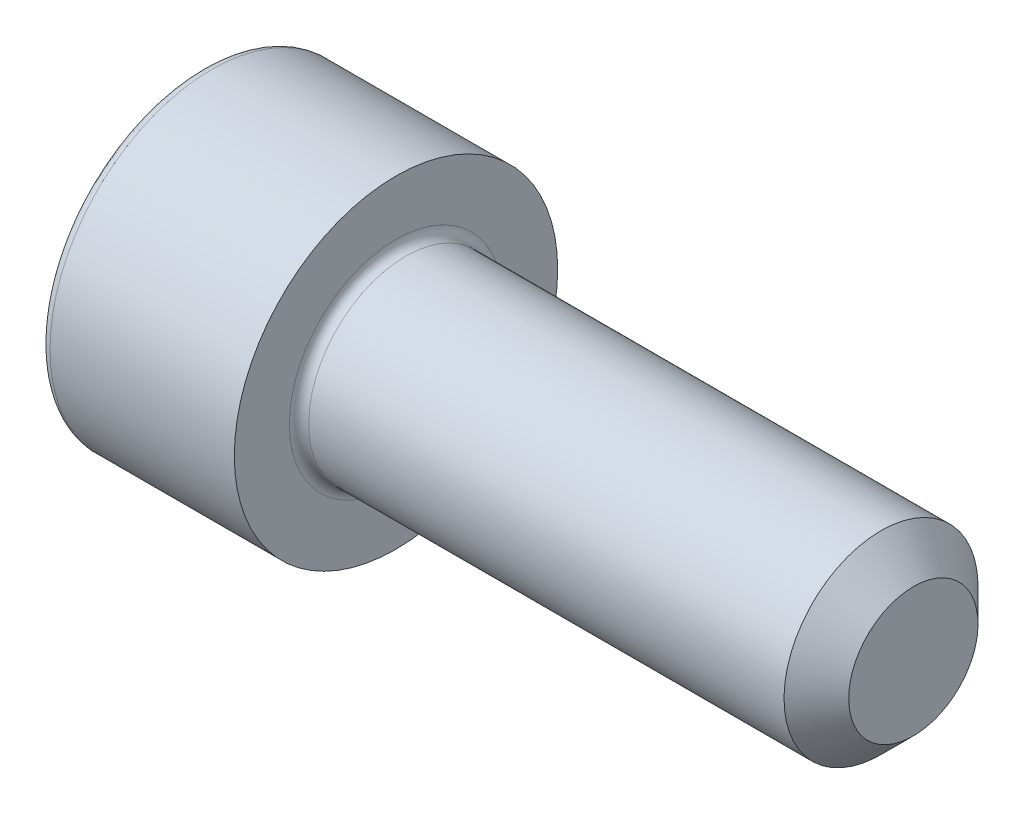
ISO-10303-21;
HEADER;
FILE_DESCRIPTION(('STEP AP214'),'2;1');
FILE_NAME('part.step','',(''),(''),'','','');
FILE_SCHEMA(('AUTOMOTIVE_DESIGN { 1 0 10303 214 1 1 1 1 }'));
ENDSEC;
DATA;
#1=APPLICATION_CONTEXT('core data for automotive mechanical design processes');
#2=APPLICATION_PROTOCOL_DEFINITION('international standard','automotive_design',2000,#1);
#3=PRODUCT_CONTEXT('',#1,'mechanical');
#4=PRODUCT('Part','Part','',(#3));
#5=PRODUCT_RELATED_PRODUCT_CATEGORY('part','',(#4));
#6=PRODUCT_DEFINITION_FORMATION('','',#4);
#7=PRODUCT_DEFINITION_CONTEXT('part definition',#1,'design');
#8=PRODUCT_DEFINITION('design','',#6,#7);
#9=PRODUCT_DEFINITION_SHAPE('','',#8);
#10=(LENGTH_UNIT() NAMED_UNIT(*) SI_UNIT(.MILLI.,.METRE.));
#11=(NAMED_UNIT(*) PLANE_ANGLE_UNIT() SI_UNIT($,.RADIAN.));
#12=(NAMED_UNIT(*) SI_UNIT($,.STERADIAN.) SOLID_ANGLE_UNIT());
#13=UNCERTAINTY_MEASURE_WITH_UNIT(LENGTH_MEASURE(1.E-05),#10,'distance_accuracy_value','');
#14=(GEOMETRIC_REPRESENTATION_CONTEXT(3) GLOBAL_UNCERTAINTY_ASSIGNED_CONTEXT((#13)) GLOBAL_UNIT_ASSIGNED_CONTEXT((#10,
#11,#12)) REPRESENTATION_CONTEXT('',''));
#15=CARTESIAN_POINT('',(0.,0.,0.));
#16=DIRECTION('',(0.,0.,1.));
#17=DIRECTION('',(1.,0.,0.));
#18=AXIS2_PLACEMENT_3D('',#15,#16,#17);
#19=CARTESIAN_POINT('',(0.,0.,0.));
#20=DIRECTION('',(-1.,0.,0.));
#21=DIRECTION('',(0.,-1.,0.));
#22=AXIS2_PLACEMENT_3D('',#19,#20,#21);
#23=PLANE('',#22);
#24=CARTESIAN_POINT('',(0.,0.,0.));
#25=DIRECTION('',(-1.,0.,0.));
#26=DIRECTION('',(0.,-1.,0.));
#27=AXIS2_PLACEMENT_3D('',#24,#25,#26);
#28=CIRCLE('',#27,4.7);
#29=CARTESIAN_POINT('',(0.,-4.7,0.));
#30=VERTEX_POINT('',#29);
#31=EDGE_CURVE('E158',#30,#30,#28,.T.);
#32=ORIENTED_EDGE('',*,*,#31,.T.);
#33=EDGE_LOOP('',(#32));
#34=FACE_BOUND('',#33,.T.);
#35=DIRECTION('',(0.,0.,-1.));
#36=VECTOR('',#35,1.);
#37=CARTESIAN_POINT('',(0.,2.5,1.44337567297407));
#38=LINE('',#37,#36);
#39=CARTESIAN_POINT('',(0.,2.5,1.44337567297407));
#40=VERTEX_POINT('',#39);
#41=CARTESIAN_POINT('',(0.,2.5,-1.44337567297406));
#42=VERTEX_POINT('',#41);
#43=EDGE_CURVE('E54',#40,#42,#38,.T.);
#44=ORIENTED_EDGE('',*,*,#43,.F.);
#45=DIRECTION('',(0.,0.866025403784439,-0.5));
#46=VECTOR('',#45,1.);
#47=CARTESIAN_POINT('',(0.,0.,2.88675134594813));
#48=LINE('',#47,#46);
#49=CARTESIAN_POINT('',(0.,0.,2.88675134594813));
#50=VERTEX_POINT('',#49);
#51=EDGE_CURVE('E137',#50,#40,#48,.T.);
#52=ORIENTED_EDGE('',*,*,#51,.F.);
#53=DIRECTION('',(0.,0.866025403784439,0.5));
#54=VECTOR('',#53,1.);
#55=CARTESIAN_POINT('',(0.,-2.5,1.44337567297406));
#56=LINE('',#55,#54);
#57=CARTESIAN_POINT('',(0.,-2.5,1.44337567297406));
#58=VERTEX_POINT('',#57);
#59=EDGE_CURVE('E135',#58,#50,#56,.T.);
#60=ORIENTED_EDGE('',*,*,#59,.F.);
#61=DIRECTION('',(0.,0.,1.));
#62=VECTOR('',#61,1.);
#63=CARTESIAN_POINT('',(0.,-2.5,-1.44337567297407));
#64=LINE('',#63,#62);
#65=CARTESIAN_POINT('',(0.,-2.5,-1.44337567297407));
#66=VERTEX_POINT('',#65);
#67=EDGE_CURVE('E102',#66,#58,#64,.T.);
#68=ORIENTED_EDGE('',*,*,#67,.F.);
#69=DIRECTION('',(0.,-0.866025403784439,0.5));
#70=VECTOR('',#69,1.);
#71=CARTESIAN_POINT('',(0.,0.,-2.88675134594813));
#72=LINE('',#71,#70);
#73=CARTESIAN_POINT('',(0.,0.,-2.88675134594813));
#74=VERTEX_POINT('',#73);
#75=EDGE_CURVE('E131',#74,#66,#72,.T.);
#76=ORIENTED_EDGE('',*,*,#75,.F.);
#77=DIRECTION('',(0.,-0.866025403784439,-0.5));
#78=VECTOR('',#77,1.);
#79=CARTESIAN_POINT('',(0.,2.5,-1.44337567297406));
#80=LINE('',#79,#78);
#81=EDGE_CURVE('E128',#42,#74,#80,.T.);
#82=ORIENTED_EDGE('',*,*,#81,.F.);
#83=EDGE_LOOP('',(#44,#52,#60,#68,#76,#82));
#84=FACE_BOUND('',#83,.T.);
#85=ADVANCED_FACE('F38',(#34,#84),#23,.T.);
#86=CARTESIAN_POINT('',(22.,0.,0.));
#87=DIRECTION('',(1.,0.,0.));
#88=DIRECTION('',(0.,1.,0.));
#89=AXIS2_PLACEMENT_3D('',#86,#87,#88);
#90=CYLINDRICAL_SURFACE('',#89,5.);
#91=CARTESIAN_POINT('',(0.300000000000002,0.,0.));
#92=DIRECTION('',(-1.,0.,0.));
#93=DIRECTION('',(0.,-1.,0.));
#94=AXIS2_PLACEMENT_3D('',#91,#92,#93);
#95=CIRCLE('',#94,5.);
#96=CARTESIAN_POINT('',(0.300000000000002,-5.,0.));
#97=VERTEX_POINT('',#96);
#98=EDGE_CURVE('E155',#97,#97,#95,.F.);
#99=ORIENTED_EDGE('',*,*,#98,.T.);
#100=EDGE_LOOP('',(#99));
#101=FACE_BOUND('',#100,.T.);
#102=CARTESIAN_POINT('',(6.,0.,0.));
#103=DIRECTION('',(1.,0.,0.));
#104=DIRECTION('',(0.,1.,0.));
#105=AXIS2_PLACEMENT_3D('',#102,#103,#104);
#106=CIRCLE('',#105,5.);
#107=CARTESIAN_POINT('',(6.,5.,0.));
#108=VERTEX_POINT('',#107);
#109=EDGE_CURVE('E141',#108,#108,#106,.T.);
#110=ORIENTED_EDGE('',*,*,#109,.F.);
#111=EDGE_LOOP('',(#110));
#112=FACE_BOUND('',#111,.T.);
#113=ADVANCED_FACE('F175',(#101,#112),#90,.T.);
#114=CARTESIAN_POINT('',(6.,5.,0.));
#115=DIRECTION('',(1.,0.,0.));
#116=DIRECTION('',(0.,1.,0.));
#117=AXIS2_PLACEMENT_3D('',#114,#115,#116);
#118=PLANE('',#117);
#119=CARTESIAN_POINT('',(6.,0.,0.));
#120=DIRECTION('',(1.,0.,0.));
#121=DIRECTION('',(0.,1.,0.));
#122=AXIS2_PLACEMENT_3D('',#119,#120,#121);
#123=CIRCLE('',#122,3.3);
#124=CARTESIAN_POINT('',(6.,3.3,0.));
#125=VERTEX_POINT('',#124);
#126=EDGE_CURVE('E152',#125,#125,#123,.F.);
#127=ORIENTED_EDGE('',*,*,#126,.T.);
#128=EDGE_LOOP('',(#127));
#129=FACE_BOUND('',#128,.T.);
#130=ORIENTED_EDGE('',*,*,#109,.T.);
#131=EDGE_LOOP('',(#130));
#132=FACE_BOUND('',#131,.T.);
#133=ADVANCED_FACE('F181',(#129,#132),#118,.T.);
#134=CARTESIAN_POINT('',(22.,0.,0.));
#135=DIRECTION('',(1.,0.,0.));
#136=DIRECTION('',(0.,1.,0.));
#137=AXIS2_PLACEMENT_3D('',#134,#135,#136);
#138=CYLINDRICAL_SURFACE('',#137,3.);
#139=CARTESIAN_POINT('',(21.,0.,0.));
#140=DIRECTION('',(1.,0.,0.));
#141=DIRECTION('',(0.,1.,0.));
#142=AXIS2_PLACEMENT_3D('',#139,#140,#141);
#143=CIRCLE('',#142,3.);
#144=CARTESIAN_POINT('',(21.,3.,0.));
#145=VERTEX_POINT('',#144);
#146=EDGE_CURVE('E11',#145,#145,#143,.F.);
#147=ORIENTED_EDGE('',*,*,#146,.T.);
#148=EDGE_LOOP('',(#147));
#149=FACE_BOUND('',#148,.T.);
#150=CARTESIAN_POINT('',(6.3,0.,0.));
#151=DIRECTION('',(1.,0.,0.));
#152=DIRECTION('',(0.,1.,0.));
#153=AXIS2_PLACEMENT_3D('',#150,#151,#152);
#154=CIRCLE('',#153,3.);
#155=CARTESIAN_POINT('',(6.3,3.,0.));
#156=VERTEX_POINT('',#155);
#157=EDGE_CURVE('E149',#156,#156,#154,.T.);
#158=ORIENTED_EDGE('',*,*,#157,.T.);
#159=EDGE_LOOP('',(#158));
#160=FACE_BOUND('',#159,.T.);
#161=ADVANCED_FACE('F198',(#149,#160),#138,.T.);
#162=CARTESIAN_POINT('',(22.,3.,0.));
#163=DIRECTION('',(1.,0.,0.));
#164=DIRECTION('',(0.,1.,0.));
#165=AXIS2_PLACEMENT_3D('',#162,#163,#164);
#166=PLANE('',#165);
#167=CARTESIAN_POINT('',(22.,0.,0.));
#168=DIRECTION('',(1.,0.,0.));
#169=DIRECTION('',(0.,1.,0.));
#170=AXIS2_PLACEMENT_3D('',#167,#168,#169);
#171=CIRCLE('',#170,1.99999999999999);
#172=CARTESIAN_POINT('',(22.,1.99999999999999,0.));
#173=VERTEX_POINT('',#172);
#174=EDGE_CURVE('E47',#173,#173,#171,.T.);
#175=ORIENTED_EDGE('',*,*,#174,.T.);
#176=EDGE_LOOP('',(#175));
#177=FACE_BOUND('',#176,.T.);
#178=ADVANCED_FACE('F163',(#177),#166,.T.);
#179=CARTESIAN_POINT('',(2.5,2.5,1.44337567297407));
#180=DIRECTION('',(0.,1.,0.));
#181=DIRECTION('',(-1.,0.,0.));
#182=AXIS2_PLACEMENT_3D('',#179,#180,#181);
#183=PLANE('',#182);
#184=ORIENTED_EDGE('',*,*,#43,.T.);
#185=DIRECTION('',(-1.,0.,0.));
#186=VECTOR('',#185,1.);
#187=CARTESIAN_POINT('',(2.5,2.5,-1.44337567297406));
#188=LINE('',#187,#186);
#189=CARTESIAN_POINT('',(2.5,2.5,-1.44337567297406));
#190=VERTEX_POINT('',#189);
#191=EDGE_CURVE('E84',#190,#42,#188,.T.);
#192=ORIENTED_EDGE('',*,*,#191,.F.);
#193=DIRECTION('',(0.,0.,-1.));
#194=VECTOR('',#193,1.);
#195=CARTESIAN_POINT('',(2.5,2.5,1.44337567297407));
#196=LINE('',#195,#194);
#197=CARTESIAN_POINT('',(2.5,2.5,1.44337567297407));
#198=VERTEX_POINT('',#197);
#199=EDGE_CURVE('E139',#198,#190,#196,.T.);
#200=ORIENTED_EDGE('',*,*,#199,.F.);
#201=DIRECTION('',(-1.,0.,0.));
#202=VECTOR('',#201,1.);
#203=CARTESIAN_POINT('',(2.5,2.5,1.44337567297407));
#204=LINE('',#203,#202);
#205=EDGE_CURVE('E62',#198,#40,#204,.T.);
#206=ORIENTED_EDGE('',*,*,#205,.T.);
#207=EDGE_LOOP('',(#184,#192,#200,#206));
#208=FACE_BOUND('',#207,.T.);
#209=ADVANCED_FACE('F206',(#208),#183,.F.);
#210=CARTESIAN_POINT('',(2.5,0.,2.88675134594813));
#211=DIRECTION('',(0.,0.5,0.866025403784439));
#212=DIRECTION('',(0.,-0.866025403784439,0.5));
#213=AXIS2_PLACEMENT_3D('',#210,#211,#212);
#214=PLANE('',#213);
#215=ORIENTED_EDGE('',*,*,#51,.T.);
#216=ORIENTED_EDGE('',*,*,#205,.F.);
#217=DIRECTION('',(0.,0.866025403784439,-0.5));
#218=VECTOR('',#217,1.);
#219=CARTESIAN_POINT('',(2.5,0.,2.88675134594813));
#220=LINE('',#219,#218);
#221=CARTESIAN_POINT('',(2.5,0.,2.88675134594813));
#222=VERTEX_POINT('',#221);
#223=EDGE_CURVE('E114',#222,#198,#220,.T.);
#224=ORIENTED_EDGE('',*,*,#223,.F.);
#225=DIRECTION('',(-1.,0.,0.));
#226=VECTOR('',#225,1.);
#227=CARTESIAN_POINT('',(2.5,0.,2.88675134594813));
#228=LINE('',#227,#226);
#229=EDGE_CURVE('E106',#222,#50,#228,.T.);
#230=ORIENTED_EDGE('',*,*,#229,.T.);
#231=EDGE_LOOP('',(#215,#216,#224,#230));
#232=FACE_BOUND('',#231,.T.);
#233=ADVANCED_FACE('F212',(#232),#214,.F.);
#234=CARTESIAN_POINT('',(2.5,-2.5,1.44337567297406));
#235=DIRECTION('',(0.,-0.5,0.866025403784439));
#236=DIRECTION('',(0.,-0.866025403784439,-0.5));
#237=AXIS2_PLACEMENT_3D('',#234,#235,#236);
#238=PLANE('',#237);
#239=ORIENTED_EDGE('',*,*,#59,.T.);
#240=ORIENTED_EDGE('',*,*,#229,.F.);
#241=DIRECTION('',(0.,0.866025403784439,0.5));
#242=VECTOR('',#241,1.);
#243=CARTESIAN_POINT('',(2.5,-2.5,1.44337567297406));
#244=LINE('',#243,#242);
#245=CARTESIAN_POINT('',(2.5,-2.5,1.44337567297406));
#246=VERTEX_POINT('',#245);
#247=EDGE_CURVE('E110',#246,#222,#244,.T.);
#248=ORIENTED_EDGE('',*,*,#247,.F.);
#249=DIRECTION('',(-1.,0.,0.));
#250=VECTOR('',#249,1.);
#251=CARTESIAN_POINT('',(2.5,-2.5,1.44337567297406));
#252=LINE('',#251,#250);
#253=EDGE_CURVE('E95',#246,#58,#252,.T.);
#254=ORIENTED_EDGE('',*,*,#253,.T.);
#255=EDGE_LOOP('',(#239,#240,#248,#254));
#256=FACE_BOUND('',#255,.T.);
#257=ADVANCED_FACE('F111',(#256),#238,.F.);
#258=CARTESIAN_POINT('',(2.5,-2.5,-1.44337567297407));
#259=DIRECTION('',(0.,-1.,0.));
#260=DIRECTION('',(1.,0.,0.));
#261=AXIS2_PLACEMENT_3D('',#258,#259,#260);
#262=PLANE('',#261);
#263=ORIENTED_EDGE('',*,*,#67,.T.);
#264=ORIENTED_EDGE('',*,*,#253,.F.);
#265=DIRECTION('',(0.,0.,1.));
#266=VECTOR('',#265,1.);
#267=CARTESIAN_POINT('',(2.5,-2.5,-1.44337567297407));
#268=LINE('',#267,#266);
#269=CARTESIAN_POINT('',(2.5,-2.5,-1.44337567297407));
#270=VERTEX_POINT('',#269);
#271=EDGE_CURVE('E99',#270,#246,#268,.T.);
#272=ORIENTED_EDGE('',*,*,#271,.F.);
#273=DIRECTION('',(-1.,0.,0.));
#274=VECTOR('',#273,1.);
#275=CARTESIAN_POINT('',(2.5,-2.5,-1.44337567297407));
#276=LINE('',#275,#274);
#277=EDGE_CURVE('E107',#270,#66,#276,.T.);
#278=ORIENTED_EDGE('',*,*,#277,.T.);
#279=EDGE_LOOP('',(#263,#264,#272,#278));
#280=FACE_BOUND('',#279,.T.);
#281=ADVANCED_FACE('F97',(#280),#262,.F.);
#282=CARTESIAN_POINT('',(2.5,0.,-2.88675134594813));
#283=DIRECTION('',(0.,-0.5,-0.866025403784439));
#284=DIRECTION('',(0.,0.866025403784439,-0.5));
#285=AXIS2_PLACEMENT_3D('',#282,#283,#284);
#286=PLANE('',#285);
#287=ORIENTED_EDGE('',*,*,#75,.T.);
#288=ORIENTED_EDGE('',*,*,#277,.F.);
#289=DIRECTION('',(0.,-0.866025403784439,0.5));
#290=VECTOR('',#289,1.);
#291=CARTESIAN_POINT('',(2.5,0.,-2.88675134594813));
#292=LINE('',#291,#290);
#293=CARTESIAN_POINT('',(2.5,0.,-2.88675134594813));
#294=VERTEX_POINT('',#293);
#295=EDGE_CURVE('E120',#294,#270,#292,.T.);
#296=ORIENTED_EDGE('',*,*,#295,.F.);
#297=DIRECTION('',(-1.,0.,0.));
#298=VECTOR('',#297,1.);
#299=CARTESIAN_POINT('',(2.5,0.,-2.88675134594813));
#300=LINE('',#299,#298);
#301=EDGE_CURVE('E144',#294,#74,#300,.T.);
#302=ORIENTED_EDGE('',*,*,#301,.T.);
#303=EDGE_LOOP('',(#287,#288,#296,#302));
#304=FACE_BOUND('',#303,.T.);
#305=ADVANCED_FACE('F215',(#304),#286,.F.);
#306=CARTESIAN_POINT('',(2.5,2.5,-1.44337567297406));
#307=DIRECTION('',(0.,0.5,-0.866025403784439));
#308=DIRECTION('',(0.,0.866025403784439,0.5));
#309=AXIS2_PLACEMENT_3D('',#306,#307,#308);
#310=PLANE('',#309);
#311=ORIENTED_EDGE('',*,*,#81,.T.);
#312=ORIENTED_EDGE('',*,*,#301,.F.);
#313=DIRECTION('',(0.,-0.866025403784439,-0.5));
#314=VECTOR('',#313,1.);
#315=CARTESIAN_POINT('',(2.5,2.5,-1.44337567297406));
#316=LINE('',#315,#314);
#317=EDGE_CURVE('E122',#190,#294,#316,.T.);
#318=ORIENTED_EDGE('',*,*,#317,.F.);
#319=ORIENTED_EDGE('',*,*,#191,.T.);
#320=EDGE_LOOP('',(#311,#312,#318,#319));
#321=FACE_BOUND('',#320,.T.);
#322=ADVANCED_FACE('F192',(#321),#310,.F.);
#323=CARTESIAN_POINT('',(2.5,0.,0.));
#324=DIRECTION('',(-1.,0.,0.));
#325=DIRECTION('',(0.,-1.,0.));
#326=AXIS2_PLACEMENT_3D('',#323,#324,#325);
#327=PLANE('',#326);
#328=ORIENTED_EDGE('',*,*,#199,.T.);
#329=ORIENTED_EDGE('',*,*,#317,.T.);
#330=ORIENTED_EDGE('',*,*,#295,.T.);
#331=ORIENTED_EDGE('',*,*,#271,.T.);
#332=ORIENTED_EDGE('',*,*,#247,.T.);
#333=ORIENTED_EDGE('',*,*,#223,.T.);
#334=EDGE_LOOP('',(#328,#329,#330,#331,#332,#333));
#335=FACE_BOUND('',#334,.T.);
#336=ADVANCED_FACE('F117',(#335),#327,.T.);
#337=CARTESIAN_POINT('',(6.3,0.,0.));
#338=DIRECTION('',(1.,0.,0.));
#339=DIRECTION('',(0.,1.,0.));
#340=AXIS2_PLACEMENT_3D('',#337,#338,#339);
#341=TOROIDAL_SURFACE('',#340,3.3,0.3);
#342=ORIENTED_EDGE('',*,*,#126,.F.);
#343=EDGE_LOOP('',(#342));
#344=FACE_BOUND('',#343,.T.);
#345=ORIENTED_EDGE('',*,*,#157,.F.);
#346=EDGE_LOOP('',(#345));
#347=FACE_BOUND('',#346,.T.);
#348=ADVANCED_FACE('F171',(#344,#347),#341,.F.);
#349=CARTESIAN_POINT('',(0.300000000000002,0.,0.));
#350=DIRECTION('',(-1.,0.,0.));
#351=DIRECTION('',(0.,-1.,0.));
#352=AXIS2_PLACEMENT_3D('',#349,#350,#351);
#353=TOROIDAL_SURFACE('',#352,4.7,0.3);
#354=ORIENTED_EDGE('',*,*,#31,.F.);
#355=EDGE_LOOP('',(#354));
#356=FACE_BOUND('',#355,.T.);
#357=ORIENTED_EDGE('',*,*,#98,.F.);
#358=EDGE_LOOP('',(#357));
#359=FACE_BOUND('',#358,.T.);
#360=ADVANCED_FACE('F166',(#356,#359),#353,.T.);
#361=CARTESIAN_POINT('',(22.,0.,0.));
#362=DIRECTION('',(-1.,0.,0.));
#363=DIRECTION('',(0.,-1.,0.));
#364=AXIS2_PLACEMENT_3D('',#361,#362,#363);
#365=CONICAL_SURFACE('',#364,1.99999999999999,0.785398163397447);
#366=ORIENTED_EDGE('',*,*,#146,.F.);
#367=EDGE_LOOP('',(#366));
#368=FACE_BOUND('',#367,.T.);
#369=ORIENTED_EDGE('',*,*,#174,.F.);
#370=EDGE_LOOP('',(#369));
#371=FACE_BOUND('',#370,.T.);
#372=ADVANCED_FACE('F41',(#368,#371),#365,.T.);
#373=CLOSED_SHELL('',(#85,#113,#133,#161,#178,#209,#233,#257,#281,#305,#322,#336,#348,#360,#372));
#374=MANIFOLD_SOLID_BREP('B2',#373);
#375=ADVANCED_BREP_SHAPE_REPRESENTATION('',(#18,#374),#14);
#376=SHAPE_DEFINITION_REPRESENTATION(#9,#375);
ENDSEC;
END-ISO-10303-21;
